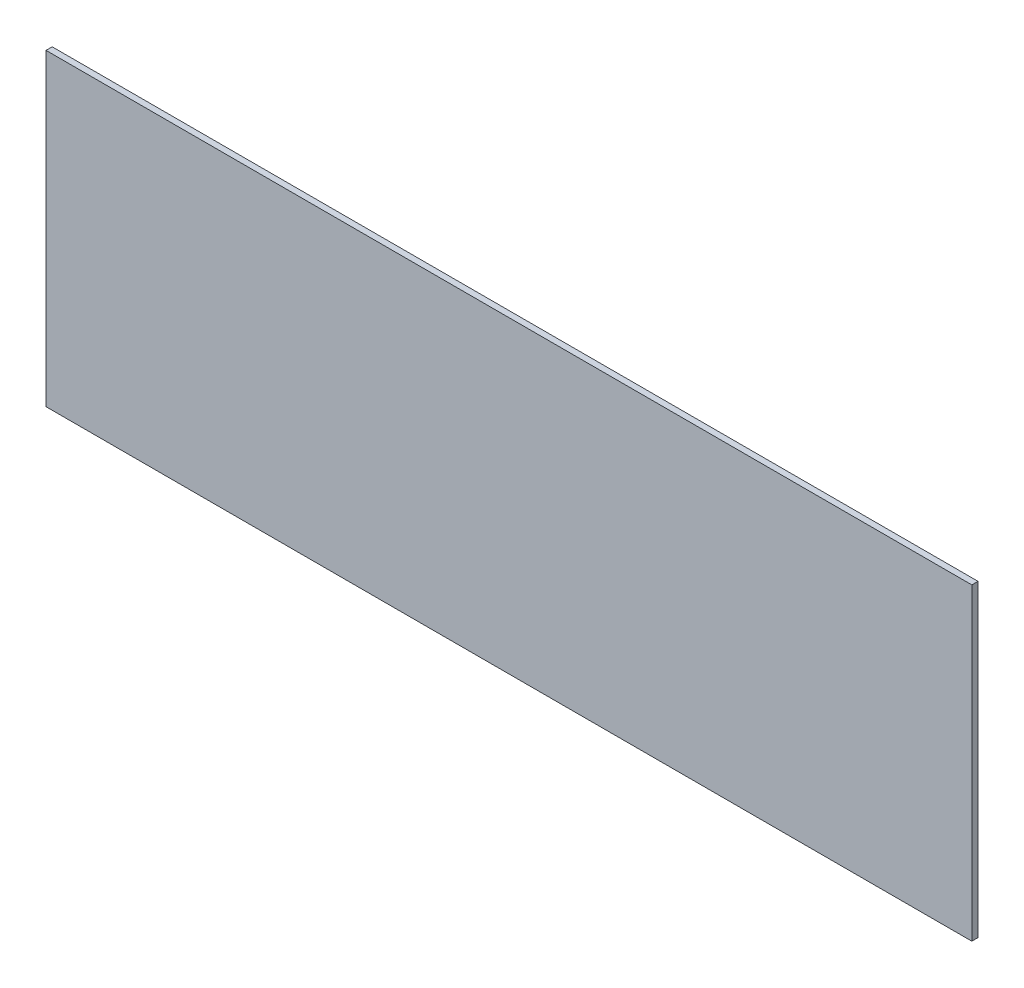
ISO-10303-21;
HEADER;
FILE_DESCRIPTION(('STEP AP214'),'2;1');
FILE_NAME('part.step','',(''),(''),'','','');
FILE_SCHEMA(('AUTOMOTIVE_DESIGN { 1 0 10303 214 1 1 1 1 }'));
ENDSEC;
DATA;
#1=APPLICATION_CONTEXT('core data for automotive mechanical design processes');
#2=APPLICATION_PROTOCOL_DEFINITION('international standard','automotive_design',2000,#1);
#3=PRODUCT_CONTEXT('',#1,'mechanical');
#4=PRODUCT('Part','Part','',(#3));
#5=PRODUCT_RELATED_PRODUCT_CATEGORY('part','',(#4));
#6=PRODUCT_DEFINITION_FORMATION('','',#4);
#7=PRODUCT_DEFINITION_CONTEXT('part definition',#1,'design');
#8=PRODUCT_DEFINITION('design','',#6,#7);
#9=PRODUCT_DEFINITION_SHAPE('','',#8);
#10=(LENGTH_UNIT() NAMED_UNIT(*) SI_UNIT(.MILLI.,.METRE.));
#11=(NAMED_UNIT(*) PLANE_ANGLE_UNIT() SI_UNIT($,.RADIAN.));
#12=(NAMED_UNIT(*) SI_UNIT($,.STERADIAN.) SOLID_ANGLE_UNIT());
#13=UNCERTAINTY_MEASURE_WITH_UNIT(LENGTH_MEASURE(1.E-05),#10,'distance_accuracy_value','');
#14=(GEOMETRIC_REPRESENTATION_CONTEXT(3) GLOBAL_UNCERTAINTY_ASSIGNED_CONTEXT((#13)) GLOBAL_UNIT_ASSIGNED_CONTEXT((#10,
#11,#12)) REPRESENTATION_CONTEXT('',''));
#15=CARTESIAN_POINT('',(0.,0.,0.));
#16=DIRECTION('',(0.,0.,1.));
#17=DIRECTION('',(1.,0.,0.));
#18=AXIS2_PLACEMENT_3D('',#15,#16,#17);
#19=CARTESIAN_POINT('',(600.,200.,4.));
#20=DIRECTION('',(-1.,0.,0.));
#21=DIRECTION('',(0.,-1.,0.));
#22=AXIS2_PLACEMENT_3D('',#19,#20,#21);
#23=PLANE('',#22);
#24=DIRECTION('',(0.,1.,0.));
#25=VECTOR('',#24,1.);
#26=CARTESIAN_POINT('',(600.,200.,0.));
#27=LINE('',#26,#25);
#28=CARTESIAN_POINT('',(600.,0.,0.));
#29=VERTEX_POINT('',#28);
#30=CARTESIAN_POINT('',(600.,200.,0.));
#31=VERTEX_POINT('',#30);
#32=EDGE_CURVE('E99',#29,#31,#27,.T.);
#33=ORIENTED_EDGE('',*,*,#32,.T.);
#34=DIRECTION('',(0.,0.,-1.));
#35=VECTOR('',#34,1.);
#36=CARTESIAN_POINT('',(600.,200.,4.));
#37=LINE('',#36,#35);
#38=CARTESIAN_POINT('',(600.,200.,4.));
#39=VERTEX_POINT('',#38);
#40=EDGE_CURVE('E11',#39,#31,#37,.T.);
#41=ORIENTED_EDGE('',*,*,#40,.F.);
#42=DIRECTION('',(0.,1.,0.));
#43=VECTOR('',#42,1.);
#44=CARTESIAN_POINT('',(600.,200.,4.));
#45=LINE('',#44,#43);
#46=CARTESIAN_POINT('',(600.,0.,4.));
#47=VERTEX_POINT('',#46);
#48=EDGE_CURVE('E87',#47,#39,#45,.T.);
#49=ORIENTED_EDGE('',*,*,#48,.F.);
#50=DIRECTION('',(0.,0.,-1.));
#51=VECTOR('',#50,1.);
#52=CARTESIAN_POINT('',(600.,0.,4.));
#53=LINE('',#52,#51);
#54=EDGE_CURVE('E95',#47,#29,#53,.T.);
#55=ORIENTED_EDGE('',*,*,#54,.T.);
#56=EDGE_LOOP('',(#33,#41,#49,#55));
#57=FACE_BOUND('',#56,.T.);
#58=ADVANCED_FACE('F36',(#57),#23,.F.);
#59=CARTESIAN_POINT('',(600.,200.,4.));
#60=DIRECTION('',(0.,-1.,0.));
#61=DIRECTION('',(1.,0.,0.));
#62=AXIS2_PLACEMENT_3D('',#59,#60,#61);
#63=PLANE('',#62);
#64=DIRECTION('',(-1.,0.,0.));
#65=VECTOR('',#64,1.);
#66=CARTESIAN_POINT('',(600.,200.,0.));
#67=LINE('',#66,#65);
#68=CARTESIAN_POINT('',(0.,200.,0.));
#69=VERTEX_POINT('',#68);
#70=EDGE_CURVE('E91',#31,#69,#67,.T.);
#71=ORIENTED_EDGE('',*,*,#70,.T.);
#72=DIRECTION('',(0.,0.,-1.));
#73=VECTOR('',#72,1.);
#74=CARTESIAN_POINT('',(0.,200.,4.));
#75=LINE('',#74,#73);
#76=CARTESIAN_POINT('',(0.,200.,4.));
#77=VERTEX_POINT('',#76);
#78=EDGE_CURVE('E44',#77,#69,#75,.T.);
#79=ORIENTED_EDGE('',*,*,#78,.F.);
#80=DIRECTION('',(-1.,0.,0.));
#81=VECTOR('',#80,1.);
#82=CARTESIAN_POINT('',(600.,200.,4.));
#83=LINE('',#82,#81);
#84=EDGE_CURVE('E82',#39,#77,#83,.T.);
#85=ORIENTED_EDGE('',*,*,#84,.F.);
#86=ORIENTED_EDGE('',*,*,#40,.T.);
#87=EDGE_LOOP('',(#71,#79,#85,#86));
#88=FACE_BOUND('',#87,.T.);
#89=ADVANCED_FACE('F90',(#88),#63,.F.);
#90=CARTESIAN_POINT('',(0.,200.,4.));
#91=DIRECTION('',(1.,0.,0.));
#92=DIRECTION('',(0.,1.,0.));
#93=AXIS2_PLACEMENT_3D('',#90,#91,#92);
#94=PLANE('',#93);
#95=DIRECTION('',(0.,-1.,0.));
#96=VECTOR('',#95,1.);
#97=CARTESIAN_POINT('',(0.,200.,0.));
#98=LINE('',#97,#96);
#99=CARTESIAN_POINT('',(0.,0.,0.));
#100=VERTEX_POINT('',#99);
#101=EDGE_CURVE('E69',#69,#100,#98,.T.);
#102=ORIENTED_EDGE('',*,*,#101,.T.);
#103=DIRECTION('',(0.,0.,-1.));
#104=VECTOR('',#103,1.);
#105=CARTESIAN_POINT('',(0.,0.,4.));
#106=LINE('',#105,#104);
#107=CARTESIAN_POINT('',(0.,0.,4.));
#108=VERTEX_POINT('',#107);
#109=EDGE_CURVE('E92',#108,#100,#106,.T.);
#110=ORIENTED_EDGE('',*,*,#109,.F.);
#111=DIRECTION('',(0.,-1.,0.));
#112=VECTOR('',#111,1.);
#113=CARTESIAN_POINT('',(0.,200.,4.));
#114=LINE('',#113,#112);
#115=EDGE_CURVE('E85',#77,#108,#114,.T.);
#116=ORIENTED_EDGE('',*,*,#115,.F.);
#117=ORIENTED_EDGE('',*,*,#78,.T.);
#118=EDGE_LOOP('',(#102,#110,#116,#117));
#119=FACE_BOUND('',#118,.T.);
#120=ADVANCED_FACE('F93',(#119),#94,.F.);
#121=CARTESIAN_POINT('',(600.,0.,4.));
#122=DIRECTION('',(0.,1.,0.));
#123=DIRECTION('',(-1.,0.,0.));
#124=AXIS2_PLACEMENT_3D('',#121,#122,#123);
#125=PLANE('',#124);
#126=DIRECTION('',(1.,0.,0.));
#127=VECTOR('',#126,1.);
#128=CARTESIAN_POINT('',(600.,0.,0.));
#129=LINE('',#128,#127);
#130=EDGE_CURVE('E75',#100,#29,#129,.T.);
#131=ORIENTED_EDGE('',*,*,#130,.T.);
#132=ORIENTED_EDGE('',*,*,#54,.F.);
#133=DIRECTION('',(1.,0.,0.));
#134=VECTOR('',#133,1.);
#135=CARTESIAN_POINT('',(600.,0.,4.));
#136=LINE('',#135,#134);
#137=EDGE_CURVE('E52',#108,#47,#136,.T.);
#138=ORIENTED_EDGE('',*,*,#137,.F.);
#139=ORIENTED_EDGE('',*,*,#109,.T.);
#140=EDGE_LOOP('',(#131,#132,#138,#139));
#141=FACE_BOUND('',#140,.T.);
#142=ADVANCED_FACE('F106',(#141),#125,.F.);
#143=CARTESIAN_POINT('',(0.,0.,4.));
#144=DIRECTION('',(0.,0.,-1.));
#145=DIRECTION('',(-1.,0.,0.));
#146=AXIS2_PLACEMENT_3D('',#143,#144,#145);
#147=PLANE('',#146);
#148=ORIENTED_EDGE('',*,*,#48,.T.);
#149=ORIENTED_EDGE('',*,*,#84,.T.);
#150=ORIENTED_EDGE('',*,*,#115,.T.);
#151=ORIENTED_EDGE('',*,*,#137,.T.);
#152=EDGE_LOOP('',(#148,#149,#150,#151));
#153=FACE_BOUND('',#152,.T.);
#154=ADVANCED_FACE('F83',(#153),#147,.F.);
#155=CARTESIAN_POINT('',(0.,0.,0.));
#156=DIRECTION('',(0.,0.,-1.));
#157=DIRECTION('',(-1.,0.,0.));
#158=AXIS2_PLACEMENT_3D('',#155,#156,#157);
#159=PLANE('',#158);
#160=ORIENTED_EDGE('',*,*,#32,.F.);
#161=ORIENTED_EDGE('',*,*,#130,.F.);
#162=ORIENTED_EDGE('',*,*,#101,.F.);
#163=ORIENTED_EDGE('',*,*,#70,.F.);
#164=EDGE_LOOP('',(#160,#161,#162,#163));
#165=FACE_BOUND('',#164,.T.);
#166=ADVANCED_FACE('F109',(#165),#159,.T.);
#167=CLOSED_SHELL('',(#58,#89,#120,#142,#154,#166));
#168=MANIFOLD_SOLID_BREP('B2',#167);
#169=ADVANCED_BREP_SHAPE_REPRESENTATION('',(#18,#168),#14);
#170=SHAPE_DEFINITION_REPRESENTATION(#9,#169);
ENDSEC;
END-ISO-10303-21;
